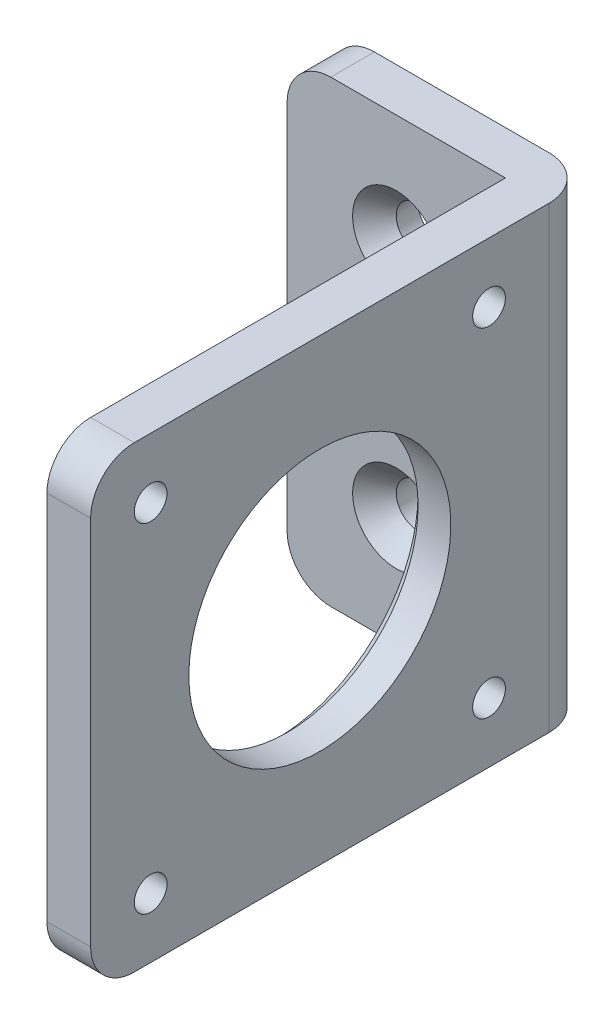
ISO-10303-21;
HEADER;
FILE_DESCRIPTION(('STEP AP214'),'2;1');
FILE_NAME('part.step','',(''),(''),'','','');
FILE_SCHEMA(('AUTOMOTIVE_DESIGN { 1 0 10303 214 1 1 1 1 }'));
ENDSEC;
DATA;
#1=APPLICATION_CONTEXT('core data for automotive mechanical design processes');
#2=APPLICATION_PROTOCOL_DEFINITION('international standard','automotive_design',2000,#1);
#3=PRODUCT_CONTEXT('',#1,'mechanical');
#4=PRODUCT('Part','Part','',(#3));
#5=PRODUCT_RELATED_PRODUCT_CATEGORY('part','',(#4));
#6=PRODUCT_DEFINITION_FORMATION('','',#4);
#7=PRODUCT_DEFINITION_CONTEXT('part definition',#1,'design');
#8=PRODUCT_DEFINITION('design','',#6,#7);
#9=PRODUCT_DEFINITION_SHAPE('','',#8);
#10=(LENGTH_UNIT() NAMED_UNIT(*) SI_UNIT(.MILLI.,.METRE.));
#11=(NAMED_UNIT(*) PLANE_ANGLE_UNIT() SI_UNIT($,.RADIAN.));
#12=(NAMED_UNIT(*) SI_UNIT($,.STERADIAN.) SOLID_ANGLE_UNIT());
#13=UNCERTAINTY_MEASURE_WITH_UNIT(LENGTH_MEASURE(1.E-05),#10,'distance_accuracy_value','');
#14=(GEOMETRIC_REPRESENTATION_CONTEXT(3) GLOBAL_UNCERTAINTY_ASSIGNED_CONTEXT((#13)) GLOBAL_UNIT_ASSIGNED_CONTEXT((#10,
#11,#12)) REPRESENTATION_CONTEXT('',''));
#15=CARTESIAN_POINT('',(0.,0.,0.));
#16=DIRECTION('',(0.,0.,1.));
#17=DIRECTION('',(1.,0.,0.));
#18=AXIS2_PLACEMENT_3D('',#15,#16,#17);
#19=CARTESIAN_POINT('',(-20.,42.,-46.));
#20=DIRECTION('',(0.,0.,1.));
#21=DIRECTION('',(1.,0.,0.));
#22=AXIS2_PLACEMENT_3D('',#19,#20,#21);
#23=PLANE('',#22);
#24=DIRECTION('',(-1.,0.,0.));
#25=VECTOR('',#24,1.);
#26=CARTESIAN_POINT('',(-20.,42.,-46.));
#27=LINE('',#26,#25);
#28=CARTESIAN_POINT('',(0.,42.,-46.));
#29=VERTEX_POINT('',#28);
#30=CARTESIAN_POINT('',(-16.,42.,-46.));
#31=VERTEX_POINT('',#30);
#32=EDGE_CURVE('E133',#29,#31,#27,.T.);
#33=ORIENTED_EDGE('',*,*,#32,.F.);
#34=DIRECTION('',(0.,-1.,0.));
#35=VECTOR('',#34,1.);
#36=CARTESIAN_POINT('',(0.,42.,-46.));
#37=LINE('',#36,#35);
#38=CARTESIAN_POINT('',(0.,0.,-46.));
#39=VERTEX_POINT('',#38);
#40=EDGE_CURVE('E196',#29,#39,#37,.T.);
#41=ORIENTED_EDGE('',*,*,#40,.T.);
#42=DIRECTION('',(-1.,0.,0.));
#43=VECTOR('',#42,1.);
#44=CARTESIAN_POINT('',(-20.,0.,-46.));
#45=LINE('',#44,#43);
#46=CARTESIAN_POINT('',(-16.,0.,-46.));
#47=VERTEX_POINT('',#46);
#48=EDGE_CURVE('E159',#39,#47,#45,.T.);
#49=ORIENTED_EDGE('',*,*,#48,.T.);
#50=CARTESIAN_POINT('',(-16.,4.,-46.));
#51=DIRECTION('',(0.,0.,1.));
#52=DIRECTION('',(1.,0.,0.));
#53=AXIS2_PLACEMENT_3D('',#50,#51,#52);
#54=CIRCLE('',#53,4.);
#55=CARTESIAN_POINT('',(-20.,4.00000000000001,-46.));
#56=VERTEX_POINT('',#55);
#57=EDGE_CURVE('E194',#47,#56,#54,.F.);
#58=ORIENTED_EDGE('',*,*,#57,.T.);
#59=DIRECTION('',(0.,-1.,0.));
#60=VECTOR('',#59,1.);
#61=CARTESIAN_POINT('',(-20.,42.,-46.));
#62=LINE('',#61,#60);
#63=CARTESIAN_POINT('',(-20.,38.,-46.));
#64=VERTEX_POINT('',#63);
#65=EDGE_CURVE('E168',#64,#56,#62,.T.);
#66=ORIENTED_EDGE('',*,*,#65,.F.);
#67=CARTESIAN_POINT('',(-16.,38.,-46.));
#68=DIRECTION('',(0.,0.,1.));
#69=DIRECTION('',(1.,0.,0.));
#70=AXIS2_PLACEMENT_3D('',#67,#68,#69);
#71=CIRCLE('',#70,4.);
#72=EDGE_CURVE('E192',#64,#31,#71,.F.);
#73=ORIENTED_EDGE('',*,*,#72,.T.);
#74=EDGE_LOOP('',(#33,#41,#49,#58,#66,#73));
#75=FACE_BOUND('',#74,.T.);
#76=CARTESIAN_POINT('',(-10.,9.99999999999999,-46.));
#77=DIRECTION('',(0.,0.,1.));
#78=DIRECTION('',(1.,0.,0.));
#79=AXIS2_PLACEMENT_3D('',#76,#77,#78);
#80=CIRCLE('',#79,2.);
#81=CARTESIAN_POINT('',(-8.00000000000003,9.99999999999999,-46.));
#82=VERTEX_POINT('',#81);
#83=EDGE_CURVE('E280',#82,#82,#80,.F.);
#84=ORIENTED_EDGE('',*,*,#83,.F.);
#85=EDGE_LOOP('',(#84));
#86=FACE_BOUND('',#85,.T.);
#87=CARTESIAN_POINT('',(-10.,32.,-46.));
#88=DIRECTION('',(0.,0.,1.));
#89=DIRECTION('',(1.,0.,0.));
#90=AXIS2_PLACEMENT_3D('',#87,#88,#89);
#91=CIRCLE('',#90,2.);
#92=CARTESIAN_POINT('',(-8.,32.,-46.));
#93=VERTEX_POINT('',#92);
#94=EDGE_CURVE('E260',#93,#93,#91,.T.);
#95=ORIENTED_EDGE('',*,*,#94,.T.);
#96=EDGE_LOOP('',(#95));
#97=FACE_BOUND('',#96,.T.);
#98=ADVANCED_FACE('F40',(#75,#86,#97),#23,.F.);
#99=CARTESIAN_POINT('',(0.,42.,-42.));
#100=DIRECTION('',(0.,0.,-1.));
#101=DIRECTION('',(-1.,0.,0.));
#102=AXIS2_PLACEMENT_3D('',#99,#100,#101);
#103=PLANE('',#102);
#104=CARTESIAN_POINT('',(-10.,32.,-42.));
#105=DIRECTION('',(0.,0.,-1.));
#106=DIRECTION('',(-1.,0.,0.));
#107=AXIS2_PLACEMENT_3D('',#104,#105,#106);
#108=CIRCLE('',#107,4.);
#109=CARTESIAN_POINT('',(-14.,32.,-42.));
#110=VERTEX_POINT('',#109);
#111=EDGE_CURVE('E180',#110,#110,#108,.T.);
#112=ORIENTED_EDGE('',*,*,#111,.T.);
#113=EDGE_LOOP('',(#112));
#114=FACE_BOUND('',#113,.T.);
#115=CARTESIAN_POINT('',(-10.,9.99999999999999,-42.));
#116=DIRECTION('',(0.,0.,-1.));
#117=DIRECTION('',(-1.,0.,0.));
#118=AXIS2_PLACEMENT_3D('',#115,#116,#117);
#119=CIRCLE('',#118,4.00000000000001);
#120=CARTESIAN_POINT('',(-14.,9.99999999999999,-42.));
#121=VERTEX_POINT('',#120);
#122=EDGE_CURVE('E177',#121,#121,#119,.T.);
#123=ORIENTED_EDGE('',*,*,#122,.T.);
#124=EDGE_LOOP('',(#123));
#125=FACE_BOUND('',#124,.T.);
#126=DIRECTION('',(0.,-1.,0.));
#127=VECTOR('',#126,1.);
#128=CARTESIAN_POINT('',(-20.,42.,-42.));
#129=LINE('',#128,#127);
#130=CARTESIAN_POINT('',(-20.,38.,-42.));
#131=VERTEX_POINT('',#130);
#132=CARTESIAN_POINT('',(-20.,4.00000000000001,-42.));
#133=VERTEX_POINT('',#132);
#134=EDGE_CURVE('E143',#131,#133,#129,.T.);
#135=ORIENTED_EDGE('',*,*,#134,.T.);
#136=CARTESIAN_POINT('',(-16.,4.,-42.));
#137=DIRECTION('',(0.,0.,-1.));
#138=DIRECTION('',(-1.,0.,0.));
#139=AXIS2_PLACEMENT_3D('',#136,#137,#138);
#140=CIRCLE('',#139,4.);
#141=CARTESIAN_POINT('',(-16.,0.,-42.));
#142=VERTEX_POINT('',#141);
#143=EDGE_CURVE('E12',#133,#142,#140,.F.);
#144=ORIENTED_EDGE('',*,*,#143,.T.);
#145=DIRECTION('',(1.,0.,0.));
#146=VECTOR('',#145,1.);
#147=CARTESIAN_POINT('',(0.,0.,-42.));
#148=LINE('',#147,#146);
#149=CARTESIAN_POINT('',(0.,0.,-42.));
#150=VERTEX_POINT('',#149);
#151=EDGE_CURVE('E139',#142,#150,#148,.T.);
#152=ORIENTED_EDGE('',*,*,#151,.T.);
#153=DIRECTION('',(0.,-1.,0.));
#154=VECTOR('',#153,1.);
#155=CARTESIAN_POINT('',(0.,42.,-42.));
#156=LINE('',#155,#154);
#157=CARTESIAN_POINT('',(0.,42.,-42.));
#158=VERTEX_POINT('',#157);
#159=EDGE_CURVE('E136',#158,#150,#156,.T.);
#160=ORIENTED_EDGE('',*,*,#159,.F.);
#161=DIRECTION('',(1.,0.,0.));
#162=VECTOR('',#161,1.);
#163=CARTESIAN_POINT('',(0.,42.,-42.));
#164=LINE('',#163,#162);
#165=CARTESIAN_POINT('',(-16.,42.,-42.));
#166=VERTEX_POINT('',#165);
#167=EDGE_CURVE('E122',#166,#158,#164,.T.);
#168=ORIENTED_EDGE('',*,*,#167,.F.);
#169=CARTESIAN_POINT('',(-16.,38.,-42.));
#170=DIRECTION('',(0.,0.,-1.));
#171=DIRECTION('',(-1.,0.,0.));
#172=AXIS2_PLACEMENT_3D('',#169,#170,#171);
#173=CIRCLE('',#172,4.);
#174=EDGE_CURVE('E48',#166,#131,#173,.F.);
#175=ORIENTED_EDGE('',*,*,#174,.T.);
#176=EDGE_LOOP('',(#135,#144,#152,#160,#168,#175));
#177=FACE_BOUND('',#176,.T.);
#178=ADVANCED_FACE('F137',(#114,#125,#177),#103,.F.);
#179=CARTESIAN_POINT('',(4.,42.,-46.));
#180=DIRECTION('',(-1.,0.,0.));
#181=DIRECTION('',(0.,0.,1.));
#182=AXIS2_PLACEMENT_3D('',#179,#180,#181);
#183=PLANE('',#182);
#184=CARTESIAN_POINT('',(4.,5.5,-36.5));
#185=DIRECTION('',(-1.,0.,0.));
#186=DIRECTION('',(0.,0.,1.));
#187=AXIS2_PLACEMENT_3D('',#184,#185,#186);
#188=CIRCLE('',#187,1.5);
#189=CARTESIAN_POINT('',(4.,5.5,-35.));
#190=VERTEX_POINT('',#189);
#191=EDGE_CURVE('E256',#190,#190,#188,.T.);
#192=ORIENTED_EDGE('',*,*,#191,.T.);
#193=EDGE_LOOP('',(#192));
#194=FACE_BOUND('',#193,.T.);
#195=CARTESIAN_POINT('',(4.,36.5,-5.50000000000004));
#196=DIRECTION('',(-1.,0.,0.));
#197=DIRECTION('',(0.,0.,1.));
#198=AXIS2_PLACEMENT_3D('',#195,#196,#197);
#199=CIRCLE('',#198,1.5);
#200=CARTESIAN_POINT('',(4.,36.5,-4.00000000000004));
#201=VERTEX_POINT('',#200);
#202=EDGE_CURVE('E269',#201,#201,#199,.T.);
#203=ORIENTED_EDGE('',*,*,#202,.T.);
#204=EDGE_LOOP('',(#203));
#205=FACE_BOUND('',#204,.T.);
#206=CARTESIAN_POINT('',(4.,21.,-21.));
#207=DIRECTION('',(-1.,0.,0.));
#208=DIRECTION('',(0.,0.,1.));
#209=AXIS2_PLACEMENT_3D('',#206,#207,#208);
#210=CIRCLE('',#209,12.);
#211=CARTESIAN_POINT('',(4.,21.,-9.00000000000001));
#212=VERTEX_POINT('',#211);
#213=EDGE_CURVE('E160',#212,#212,#210,.T.);
#214=ORIENTED_EDGE('',*,*,#213,.T.);
#215=EDGE_LOOP('',(#214));
#216=FACE_BOUND('',#215,.T.);
#217=DIRECTION('',(0.,0.,-1.));
#218=VECTOR('',#217,1.);
#219=CARTESIAN_POINT('',(4.,0.,-46.));
#220=LINE('',#219,#218);
#221=CARTESIAN_POINT('',(4.,0.,-4.));
#222=VERTEX_POINT('',#221);
#223=CARTESIAN_POINT('',(4.,0.,-42.));
#224=VERTEX_POINT('',#223);
#225=EDGE_CURVE('E156',#222,#224,#220,.T.);
#226=ORIENTED_EDGE('',*,*,#225,.T.);
#227=DIRECTION('',(0.,-1.,0.));
#228=VECTOR('',#227,1.);
#229=CARTESIAN_POINT('',(4.,42.,-42.));
#230=LINE('',#229,#228);
#231=CARTESIAN_POINT('',(4.,42.,-42.));
#232=VERTEX_POINT('',#231);
#233=EDGE_CURVE('E209',#224,#232,#230,.F.);
#234=ORIENTED_EDGE('',*,*,#233,.T.);
#235=DIRECTION('',(0.,0.,-1.));
#236=VECTOR('',#235,1.);
#237=CARTESIAN_POINT('',(4.,42.,-46.));
#238=LINE('',#237,#236);
#239=CARTESIAN_POINT('',(4.,42.,-4.));
#240=VERTEX_POINT('',#239);
#241=EDGE_CURVE('E165',#240,#232,#238,.T.);
#242=ORIENTED_EDGE('',*,*,#241,.F.);
#243=CARTESIAN_POINT('',(4.,38.,-4.));
#244=DIRECTION('',(-1.,0.,0.));
#245=DIRECTION('',(0.,0.,1.));
#246=AXIS2_PLACEMENT_3D('',#243,#244,#245);
#247=CIRCLE('',#246,4.);
#248=CARTESIAN_POINT('',(4.,38.,0.));
#249=VERTEX_POINT('',#248);
#250=EDGE_CURVE('E205',#240,#249,#247,.F.);
#251=ORIENTED_EDGE('',*,*,#250,.T.);
#252=DIRECTION('',(0.,-1.,0.));
#253=VECTOR('',#252,1.);
#254=CARTESIAN_POINT('',(4.,42.,0.));
#255=LINE('',#254,#253);
#256=CARTESIAN_POINT('',(4.,4.00000000000001,0.));
#257=VERTEX_POINT('',#256);
#258=EDGE_CURVE('E171',#249,#257,#255,.T.);
#259=ORIENTED_EDGE('',*,*,#258,.T.);
#260=CARTESIAN_POINT('',(4.,4.,-4.));
#261=DIRECTION('',(-1.,0.,0.));
#262=DIRECTION('',(0.,0.,1.));
#263=AXIS2_PLACEMENT_3D('',#260,#261,#262);
#264=CIRCLE('',#263,4.);
#265=EDGE_CURVE('E207',#257,#222,#264,.F.);
#266=ORIENTED_EDGE('',*,*,#265,.T.);
#267=EDGE_LOOP('',(#226,#234,#242,#251,#259,#266));
#268=FACE_BOUND('',#267,.T.);
#269=CARTESIAN_POINT('',(4.,36.5,-36.5));
#270=DIRECTION('',(-1.,0.,0.));
#271=DIRECTION('',(0.,0.,1.));
#272=AXIS2_PLACEMENT_3D('',#269,#270,#271);
#273=CIRCLE('',#272,1.5);
#274=CARTESIAN_POINT('',(4.,36.5,-35.));
#275=VERTEX_POINT('',#274);
#276=EDGE_CURVE('E275',#275,#275,#273,.F.);
#277=ORIENTED_EDGE('',*,*,#276,.F.);
#278=EDGE_LOOP('',(#277));
#279=FACE_BOUND('',#278,.T.);
#280=CARTESIAN_POINT('',(4.,5.5,-5.50000000000001));
#281=DIRECTION('',(-1.,0.,0.));
#282=DIRECTION('',(0.,0.,1.));
#283=AXIS2_PLACEMENT_3D('',#280,#281,#282);
#284=CIRCLE('',#283,1.5);
#285=CARTESIAN_POINT('',(4.,5.5,-4.00000000000001));
#286=VERTEX_POINT('',#285);
#287=EDGE_CURVE('E263',#286,#286,#284,.F.);
#288=ORIENTED_EDGE('',*,*,#287,.F.);
#289=EDGE_LOOP('',(#288));
#290=FACE_BOUND('',#289,.T.);
#291=ADVANCED_FACE('F246',(#194,#205,#216,#268,#279,#290),#183,.F.);
#292=CARTESIAN_POINT('',(0.,42.,0.));
#293=DIRECTION('',(1.,0.,0.));
#294=DIRECTION('',(0.,0.,-1.));
#295=AXIS2_PLACEMENT_3D('',#292,#293,#294);
#296=PLANE('',#295);
#297=CARTESIAN_POINT('',(0.,21.,-21.));
#298=DIRECTION('',(1.,0.,0.));
#299=DIRECTION('',(0.,0.,-1.));
#300=AXIS2_PLACEMENT_3D('',#297,#298,#299);
#301=CIRCLE('',#300,13.);
#302=CARTESIAN_POINT('',(0.,21.,-34.));
#303=VERTEX_POINT('',#302);
#304=EDGE_CURVE('E189',#303,#303,#301,.T.);
#305=ORIENTED_EDGE('',*,*,#304,.T.);
#306=EDGE_LOOP('',(#305));
#307=FACE_BOUND('',#306,.T.);
#308=CARTESIAN_POINT('',(0.,5.5,-36.5));
#309=DIRECTION('',(-1.,0.,0.));
#310=DIRECTION('',(0.,0.,1.));
#311=AXIS2_PLACEMENT_3D('',#308,#309,#310);
#312=CIRCLE('',#311,1.5);
#313=CARTESIAN_POINT('',(0.,5.5,-35.));
#314=VERTEX_POINT('',#313);
#315=EDGE_CURVE('E259',#314,#314,#312,.T.);
#316=ORIENTED_EDGE('',*,*,#315,.F.);
#317=EDGE_LOOP('',(#316));
#318=FACE_BOUND('',#317,.T.);
#319=CARTESIAN_POINT('',(0.,36.5,-5.50000000000004));
#320=DIRECTION('',(-1.,0.,0.));
#321=DIRECTION('',(0.,0.,1.));
#322=AXIS2_PLACEMENT_3D('',#319,#320,#321);
#323=CIRCLE('',#322,1.5);
#324=CARTESIAN_POINT('',(0.,36.5,-4.00000000000004));
#325=VERTEX_POINT('',#324);
#326=EDGE_CURVE('E272',#325,#325,#323,.T.);
#327=ORIENTED_EDGE('',*,*,#326,.F.);
#328=EDGE_LOOP('',(#327));
#329=FACE_BOUND('',#328,.T.);
#330=DIRECTION('',(0.,0.,1.));
#331=VECTOR('',#330,1.);
#332=CARTESIAN_POINT('',(0.,0.,0.));
#333=LINE('',#332,#331);
#334=CARTESIAN_POINT('',(0.,0.,-4.));
#335=VERTEX_POINT('',#334);
#336=EDGE_CURVE('E164',#150,#335,#333,.T.);
#337=ORIENTED_EDGE('',*,*,#336,.T.);
#338=CARTESIAN_POINT('',(0.,4.,-4.));
#339=DIRECTION('',(1.,0.,0.));
#340=DIRECTION('',(0.,0.,-1.));
#341=AXIS2_PLACEMENT_3D('',#338,#339,#340);
#342=CIRCLE('',#341,4.);
#343=CARTESIAN_POINT('',(0.,4.00000000000001,0.));
#344=VERTEX_POINT('',#343);
#345=EDGE_CURVE('E222',#335,#344,#342,.F.);
#346=ORIENTED_EDGE('',*,*,#345,.T.);
#347=DIRECTION('',(0.,-1.,0.));
#348=VECTOR('',#347,1.);
#349=CARTESIAN_POINT('',(0.,42.,0.));
#350=LINE('',#349,#348);
#351=CARTESIAN_POINT('',(0.,38.,0.));
#352=VERTEX_POINT('',#351);
#353=EDGE_CURVE('E144',#352,#344,#350,.T.);
#354=ORIENTED_EDGE('',*,*,#353,.F.);
#355=CARTESIAN_POINT('',(0.,38.,-4.));
#356=DIRECTION('',(1.,0.,0.));
#357=DIRECTION('',(0.,0.,-1.));
#358=AXIS2_PLACEMENT_3D('',#355,#356,#357);
#359=CIRCLE('',#358,4.);
#360=CARTESIAN_POINT('',(0.,42.,-4.));
#361=VERTEX_POINT('',#360);
#362=EDGE_CURVE('E150',#352,#361,#359,.F.);
#363=ORIENTED_EDGE('',*,*,#362,.T.);
#364=DIRECTION('',(0.,0.,1.));
#365=VECTOR('',#364,1.);
#366=CARTESIAN_POINT('',(0.,42.,0.));
#367=LINE('',#366,#365);
#368=EDGE_CURVE('E128',#158,#361,#367,.T.);
#369=ORIENTED_EDGE('',*,*,#368,.F.);
#370=ORIENTED_EDGE('',*,*,#159,.T.);
#371=EDGE_LOOP('',(#337,#346,#354,#363,#369,#370));
#372=FACE_BOUND('',#371,.T.);
#373=CARTESIAN_POINT('',(0.,36.5,-36.5));
#374=DIRECTION('',(-1.,0.,0.));
#375=DIRECTION('',(0.,0.,1.));
#376=AXIS2_PLACEMENT_3D('',#373,#374,#375);
#377=CIRCLE('',#376,1.5);
#378=CARTESIAN_POINT('',(0.,36.5,-35.));
#379=VERTEX_POINT('',#378);
#380=EDGE_CURVE('E255',#379,#379,#377,.F.);
#381=ORIENTED_EDGE('',*,*,#380,.T.);
#382=EDGE_LOOP('',(#381));
#383=FACE_BOUND('',#382,.T.);
#384=CARTESIAN_POINT('',(0.,5.5,-5.50000000000001));
#385=DIRECTION('',(-1.,0.,0.));
#386=DIRECTION('',(0.,0.,1.));
#387=AXIS2_PLACEMENT_3D('',#384,#385,#386);
#388=CIRCLE('',#387,1.5);
#389=CARTESIAN_POINT('',(0.,5.5,-4.00000000000001));
#390=VERTEX_POINT('',#389);
#391=EDGE_CURVE('E266',#390,#390,#388,.F.);
#392=ORIENTED_EDGE('',*,*,#391,.T.);
#393=EDGE_LOOP('',(#392));
#394=FACE_BOUND('',#393,.T.);
#395=ADVANCED_FACE('F146',(#307,#318,#329,#372,#383,#394),#296,.F.);
#396=CARTESIAN_POINT('',(4.,42.,0.));
#397=DIRECTION('',(0.,0.,-1.));
#398=DIRECTION('',(-1.,0.,0.));
#399=AXIS2_PLACEMENT_3D('',#396,#397,#398);
#400=PLANE('',#399);
#401=ORIENTED_EDGE('',*,*,#353,.T.);
#402=DIRECTION('',(1.,0.,0.));
#403=VECTOR('',#402,1.);
#404=CARTESIAN_POINT('',(4.,4.,0.));
#405=LINE('',#404,#403);
#406=EDGE_CURVE('E218',#344,#257,#405,.T.);
#407=ORIENTED_EDGE('',*,*,#406,.T.);
#408=ORIENTED_EDGE('',*,*,#258,.F.);
#409=DIRECTION('',(1.,0.,0.));
#410=VECTOR('',#409,1.);
#411=CARTESIAN_POINT('',(4.,38.,0.));
#412=LINE('',#411,#410);
#413=EDGE_CURVE('E216',#249,#352,#412,.F.);
#414=ORIENTED_EDGE('',*,*,#413,.T.);
#415=EDGE_LOOP('',(#401,#407,#408,#414));
#416=FACE_BOUND('',#415,.T.);
#417=ADVANCED_FACE('F315',(#416),#400,.F.);
#418=CARTESIAN_POINT('',(-20.,42.,-42.));
#419=DIRECTION('',(1.,0.,0.));
#420=DIRECTION('',(0.,0.,-1.));
#421=AXIS2_PLACEMENT_3D('',#418,#419,#420);
#422=PLANE('',#421);
#423=ORIENTED_EDGE('',*,*,#65,.T.);
#424=DIRECTION('',(0.,0.,1.));
#425=VECTOR('',#424,1.);
#426=CARTESIAN_POINT('',(-20.,4.,-42.));
#427=LINE('',#426,#425);
#428=EDGE_CURVE('E226',#56,#133,#427,.T.);
#429=ORIENTED_EDGE('',*,*,#428,.T.);
#430=ORIENTED_EDGE('',*,*,#134,.F.);
#431=DIRECTION('',(0.,0.,1.));
#432=VECTOR('',#431,1.);
#433=CARTESIAN_POINT('',(-20.,38.,-42.));
#434=LINE('',#433,#432);
#435=EDGE_CURVE('E224',#131,#64,#434,.F.);
#436=ORIENTED_EDGE('',*,*,#435,.T.);
#437=EDGE_LOOP('',(#423,#429,#430,#436));
#438=FACE_BOUND('',#437,.T.);
#439=ADVANCED_FACE('F228',(#438),#422,.F.);
#440=CARTESIAN_POINT('',(0.,42.,0.));
#441=DIRECTION('',(0.,-1.,0.));
#442=DIRECTION('',(0.,0.,-1.));
#443=AXIS2_PLACEMENT_3D('',#440,#441,#442);
#444=PLANE('',#443);
#445=ORIENTED_EDGE('',*,*,#241,.T.);
#446=CARTESIAN_POINT('',(0.,42.,-42.));
#447=DIRECTION('',(0.,-1.,0.));
#448=DIRECTION('',(0.,0.,-1.));
#449=AXIS2_PLACEMENT_3D('',#446,#447,#448);
#450=CIRCLE('',#449,4.);
#451=EDGE_CURVE('E214',#232,#29,#450,.F.);
#452=ORIENTED_EDGE('',*,*,#451,.T.);
#453=ORIENTED_EDGE('',*,*,#32,.T.);
#454=DIRECTION('',(0.,0.,1.));
#455=VECTOR('',#454,1.);
#456=CARTESIAN_POINT('',(-16.,42.,0.));
#457=LINE('',#456,#455);
#458=EDGE_CURVE('E132',#31,#166,#457,.T.);
#459=ORIENTED_EDGE('',*,*,#458,.T.);
#460=ORIENTED_EDGE('',*,*,#167,.T.);
#461=ORIENTED_EDGE('',*,*,#368,.T.);
#462=DIRECTION('',(1.,0.,0.));
#463=VECTOR('',#462,1.);
#464=CARTESIAN_POINT('',(0.,42.,-4.));
#465=LINE('',#464,#463);
#466=EDGE_CURVE('E212',#361,#240,#465,.T.);
#467=ORIENTED_EDGE('',*,*,#466,.T.);
#468=EDGE_LOOP('',(#445,#452,#453,#459,#460,#461,#467));
#469=FACE_BOUND('',#468,.T.);
#470=ADVANCED_FACE('F125',(#469),#444,.F.);
#471=CARTESIAN_POINT('',(0.,0.,0.));
#472=DIRECTION('',(0.,-1.,0.));
#473=DIRECTION('',(0.,0.,-1.));
#474=AXIS2_PLACEMENT_3D('',#471,#472,#473);
#475=PLANE('',#474);
#476=ORIENTED_EDGE('',*,*,#48,.F.);
#477=CARTESIAN_POINT('',(0.,0.,-42.));
#478=DIRECTION('',(0.,-1.,0.));
#479=DIRECTION('',(0.,0.,-1.));
#480=AXIS2_PLACEMENT_3D('',#477,#478,#479);
#481=CIRCLE('',#480,4.);
#482=EDGE_CURVE('E203',#39,#224,#481,.T.);
#483=ORIENTED_EDGE('',*,*,#482,.T.);
#484=ORIENTED_EDGE('',*,*,#225,.F.);
#485=DIRECTION('',(1.,0.,0.));
#486=VECTOR('',#485,1.);
#487=CARTESIAN_POINT('',(0.,0.,-4.));
#488=LINE('',#487,#486);
#489=EDGE_CURVE('E201',#222,#335,#488,.F.);
#490=ORIENTED_EDGE('',*,*,#489,.T.);
#491=ORIENTED_EDGE('',*,*,#336,.F.);
#492=ORIENTED_EDGE('',*,*,#151,.F.);
#493=DIRECTION('',(0.,0.,1.));
#494=VECTOR('',#493,1.);
#495=CARTESIAN_POINT('',(-16.,0.,-46.));
#496=LINE('',#495,#494);
#497=EDGE_CURVE('E199',#142,#47,#496,.F.);
#498=ORIENTED_EDGE('',*,*,#497,.T.);
#499=EDGE_LOOP('',(#476,#483,#484,#490,#491,#492,#498));
#500=FACE_BOUND('',#499,.T.);
#501=ADVANCED_FACE('F234',(#500),#475,.T.);
#502=CARTESIAN_POINT('',(4.,21.,-21.));
#503=DIRECTION('',(-1.,0.,0.));
#504=DIRECTION('',(0.,0.,1.));
#505=AXIS2_PLACEMENT_3D('',#502,#503,#504);
#506=CYLINDRICAL_SURFACE('',#505,12.);
#507=CARTESIAN_POINT('',(1.00000000000001,21.,-21.));
#508=DIRECTION('',(1.,0.,0.));
#509=DIRECTION('',(0.,0.,-1.));
#510=AXIS2_PLACEMENT_3D('',#507,#508,#509);
#511=CIRCLE('',#510,12.);
#512=CARTESIAN_POINT('',(1.00000000000001,21.,-33.));
#513=VERTEX_POINT('',#512);
#514=EDGE_CURVE('E186',#513,#513,#511,.F.);
#515=ORIENTED_EDGE('',*,*,#514,.T.);
#516=EDGE_LOOP('',(#515));
#517=FACE_BOUND('',#516,.T.);
#518=ORIENTED_EDGE('',*,*,#213,.F.);
#519=EDGE_LOOP('',(#518));
#520=FACE_BOUND('',#519,.T.);
#521=ADVANCED_FACE('F374',(#517,#520),#506,.F.);
#522=CARTESIAN_POINT('',(4.,36.5,-36.5));
#523=DIRECTION('',(-1.,0.,0.));
#524=DIRECTION('',(0.,0.,1.));
#525=AXIS2_PLACEMENT_3D('',#522,#523,#524);
#526=CYLINDRICAL_SURFACE('',#525,1.5);
#527=ORIENTED_EDGE('',*,*,#276,.T.);
#528=EDGE_LOOP('',(#527));
#529=FACE_BOUND('',#528,.T.);
#530=ORIENTED_EDGE('',*,*,#380,.F.);
#531=EDGE_LOOP('',(#530));
#532=FACE_BOUND('',#531,.T.);
#533=ADVANCED_FACE('F437',(#529,#532),#526,.F.);
#534=CARTESIAN_POINT('',(4.,36.5,-5.50000000000004));
#535=DIRECTION('',(-1.,0.,0.));
#536=DIRECTION('',(0.,0.,1.));
#537=AXIS2_PLACEMENT_3D('',#534,#535,#536);
#538=CYLINDRICAL_SURFACE('',#537,1.5);
#539=ORIENTED_EDGE('',*,*,#202,.F.);
#540=EDGE_LOOP('',(#539));
#541=FACE_BOUND('',#540,.T.);
#542=ORIENTED_EDGE('',*,*,#326,.T.);
#543=EDGE_LOOP('',(#542));
#544=FACE_BOUND('',#543,.T.);
#545=ADVANCED_FACE('F479',(#541,#544),#538,.F.);
#546=CARTESIAN_POINT('',(4.,5.5,-5.50000000000001));
#547=DIRECTION('',(-1.,0.,0.));
#548=DIRECTION('',(0.,0.,1.));
#549=AXIS2_PLACEMENT_3D('',#546,#547,#548);
#550=CYLINDRICAL_SURFACE('',#549,1.5);
#551=ORIENTED_EDGE('',*,*,#287,.T.);
#552=EDGE_LOOP('',(#551));
#553=FACE_BOUND('',#552,.T.);
#554=ORIENTED_EDGE('',*,*,#391,.F.);
#555=EDGE_LOOP('',(#554));
#556=FACE_BOUND('',#555,.T.);
#557=ADVANCED_FACE('F469',(#553,#556),#550,.F.);
#558=CARTESIAN_POINT('',(4.,5.5,-36.5));
#559=DIRECTION('',(-1.,0.,0.));
#560=DIRECTION('',(0.,0.,1.));
#561=AXIS2_PLACEMENT_3D('',#558,#559,#560);
#562=CYLINDRICAL_SURFACE('',#561,1.5);
#563=ORIENTED_EDGE('',*,*,#191,.F.);
#564=EDGE_LOOP('',(#563));
#565=FACE_BOUND('',#564,.T.);
#566=ORIENTED_EDGE('',*,*,#315,.T.);
#567=EDGE_LOOP('',(#566));
#568=FACE_BOUND('',#567,.T.);
#569=ADVANCED_FACE('F300',(#565,#568),#562,.F.);
#570=CARTESIAN_POINT('',(-10.,9.99999999999999,-46.));
#571=DIRECTION('',(0.,0.,1.));
#572=DIRECTION('',(1.,0.,0.));
#573=AXIS2_PLACEMENT_3D('',#570,#571,#572);
#574=CYLINDRICAL_SURFACE('',#573,2.);
#575=CARTESIAN_POINT('',(-10.,9.99999999999999,-44.));
#576=DIRECTION('',(0.,0.,-1.));
#577=DIRECTION('',(-1.,0.,0.));
#578=AXIS2_PLACEMENT_3D('',#575,#576,#577);
#579=CIRCLE('',#578,2.);
#580=CARTESIAN_POINT('',(-12.,9.99999999999999,-44.));
#581=VERTEX_POINT('',#580);
#582=EDGE_CURVE('E183',#581,#581,#579,.F.);
#583=ORIENTED_EDGE('',*,*,#582,.T.);
#584=EDGE_LOOP('',(#583));
#585=FACE_BOUND('',#584,.T.);
#586=ORIENTED_EDGE('',*,*,#83,.T.);
#587=EDGE_LOOP('',(#586));
#588=FACE_BOUND('',#587,.T.);
#589=ADVANCED_FACE('F290',(#585,#588),#574,.F.);
#590=CARTESIAN_POINT('',(-10.,32.,-46.));
#591=DIRECTION('',(0.,0.,1.));
#592=DIRECTION('',(1.,0.,0.));
#593=AXIS2_PLACEMENT_3D('',#590,#591,#592);
#594=CYLINDRICAL_SURFACE('',#593,2.);
#595=CARTESIAN_POINT('',(-10.,32.,-44.));
#596=DIRECTION('',(0.,0.,-1.));
#597=DIRECTION('',(-1.,0.,0.));
#598=AXIS2_PLACEMENT_3D('',#595,#596,#597);
#599=CIRCLE('',#598,2.);
#600=CARTESIAN_POINT('',(-12.,32.,-44.));
#601=VERTEX_POINT('',#600);
#602=EDGE_CURVE('E174',#601,#601,#599,.F.);
#603=ORIENTED_EDGE('',*,*,#602,.T.);
#604=EDGE_LOOP('',(#603));
#605=FACE_BOUND('',#604,.T.);
#606=ORIENTED_EDGE('',*,*,#94,.F.);
#607=EDGE_LOOP('',(#606));
#608=FACE_BOUND('',#607,.T.);
#609=ADVANCED_FACE('F287',(#605,#608),#594,.F.);
#610=CARTESIAN_POINT('',(-10.,32.,-44.));
#611=DIRECTION('',(0.,0.,1.));
#612=DIRECTION('',(1.,0.,0.));
#613=AXIS2_PLACEMENT_3D('',#610,#611,#612);
#614=CONICAL_SURFACE('',#613,2.,0.785398163397449);
#615=ORIENTED_EDGE('',*,*,#111,.F.);
#616=EDGE_LOOP('',(#615));
#617=FACE_BOUND('',#616,.T.);
#618=ORIENTED_EDGE('',*,*,#602,.F.);
#619=EDGE_LOOP('',(#618));
#620=FACE_BOUND('',#619,.T.);
#621=ADVANCED_FACE('F289',(#617,#620),#614,.F.);
#622=CARTESIAN_POINT('',(-10.,9.99999999999999,-42.));
#623=DIRECTION('',(0.,0.,1.));
#624=DIRECTION('',(1.,0.,0.));
#625=AXIS2_PLACEMENT_3D('',#622,#623,#624);
#626=CONICAL_SURFACE('',#625,4.00000000000001,0.785398163397447);
#627=ORIENTED_EDGE('',*,*,#582,.F.);
#628=EDGE_LOOP('',(#627));
#629=FACE_BOUND('',#628,.T.);
#630=ORIENTED_EDGE('',*,*,#122,.F.);
#631=EDGE_LOOP('',(#630));
#632=FACE_BOUND('',#631,.T.);
#633=ADVANCED_FACE('F297',(#629,#632),#626,.F.);
#634=CARTESIAN_POINT('',(1.00000000000001,21.,-21.));
#635=DIRECTION('',(-1.,0.,0.));
#636=DIRECTION('',(0.,0.,1.));
#637=AXIS2_PLACEMENT_3D('',#634,#635,#636);
#638=CONICAL_SURFACE('',#637,12.,0.785398163397447);
#639=ORIENTED_EDGE('',*,*,#304,.F.);
#640=EDGE_LOOP('',(#639));
#641=FACE_BOUND('',#640,.T.);
#642=ORIENTED_EDGE('',*,*,#514,.F.);
#643=EDGE_LOOP('',(#642));
#644=FACE_BOUND('',#643,.T.);
#645=ADVANCED_FACE('F321',(#641,#644),#638,.F.);
#646=CARTESIAN_POINT('',(0.,42.,-42.));
#647=DIRECTION('',(0.,-1.,0.));
#648=DIRECTION('',(0.,0.,-1.));
#649=AXIS2_PLACEMENT_3D('',#646,#647,#648);
#650=CYLINDRICAL_SURFACE('',#649,4.);
#651=ORIENTED_EDGE('',*,*,#451,.F.);
#652=ORIENTED_EDGE('',*,*,#233,.F.);
#653=ORIENTED_EDGE('',*,*,#482,.F.);
#654=ORIENTED_EDGE('',*,*,#40,.F.);
#655=EDGE_LOOP('',(#651,#652,#653,#654));
#656=FACE_BOUND('',#655,.T.);
#657=ADVANCED_FACE('F250',(#656),#650,.T.);
#658=CARTESIAN_POINT('',(4.,4.,-4.));
#659=DIRECTION('',(-1.,0.,0.));
#660=DIRECTION('',(0.,0.,1.));
#661=AXIS2_PLACEMENT_3D('',#658,#659,#660);
#662=CYLINDRICAL_SURFACE('',#661,4.);
#663=ORIENTED_EDGE('',*,*,#345,.F.);
#664=ORIENTED_EDGE('',*,*,#489,.F.);
#665=ORIENTED_EDGE('',*,*,#265,.F.);
#666=ORIENTED_EDGE('',*,*,#406,.F.);
#667=EDGE_LOOP('',(#663,#664,#665,#666));
#668=FACE_BOUND('',#667,.T.);
#669=ADVANCED_FACE('F328',(#668),#662,.T.);
#670=CARTESIAN_POINT('',(0.,38.,-4.));
#671=DIRECTION('',(1.,0.,0.));
#672=DIRECTION('',(0.,0.,-1.));
#673=AXIS2_PLACEMENT_3D('',#670,#671,#672);
#674=CYLINDRICAL_SURFACE('',#673,4.);
#675=ORIENTED_EDGE('',*,*,#362,.F.);
#676=ORIENTED_EDGE('',*,*,#413,.F.);
#677=ORIENTED_EDGE('',*,*,#250,.F.);
#678=ORIENTED_EDGE('',*,*,#466,.F.);
#679=EDGE_LOOP('',(#675,#676,#677,#678));
#680=FACE_BOUND('',#679,.T.);
#681=ADVANCED_FACE('F331',(#680),#674,.T.);
#682=CARTESIAN_POINT('',(-16.,4.,-42.));
#683=DIRECTION('',(0.,0.,-1.));
#684=DIRECTION('',(-1.,0.,0.));
#685=AXIS2_PLACEMENT_3D('',#682,#683,#684);
#686=CYLINDRICAL_SURFACE('',#685,4.);
#687=ORIENTED_EDGE('',*,*,#57,.F.);
#688=ORIENTED_EDGE('',*,*,#497,.F.);
#689=ORIENTED_EDGE('',*,*,#143,.F.);
#690=ORIENTED_EDGE('',*,*,#428,.F.);
#691=EDGE_LOOP('',(#687,#688,#689,#690));
#692=FACE_BOUND('',#691,.T.);
#693=ADVANCED_FACE('F235',(#692),#686,.T.);
#694=CARTESIAN_POINT('',(-16.,38.,0.));
#695=DIRECTION('',(0.,0.,1.));
#696=DIRECTION('',(1.,0.,0.));
#697=AXIS2_PLACEMENT_3D('',#694,#695,#696);
#698=CYLINDRICAL_SURFACE('',#697,4.);
#699=ORIENTED_EDGE('',*,*,#72,.F.);
#700=ORIENTED_EDGE('',*,*,#435,.F.);
#701=ORIENTED_EDGE('',*,*,#174,.F.);
#702=ORIENTED_EDGE('',*,*,#458,.F.);
#703=EDGE_LOOP('',(#699,#700,#701,#702));
#704=FACE_BOUND('',#703,.T.);
#705=ADVANCED_FACE('F42',(#704),#698,.T.);
#706=CLOSED_SHELL('',(#98,#178,#291,#395,#417,#439,#470,#501,#521,#533,#545,#557,#569,#589,#609,
#621,#633,#645,#657,#669,#681,#693,#705));
#707=MANIFOLD_SOLID_BREP('B2',#706);
#708=ADVANCED_BREP_SHAPE_REPRESENTATION('',(#18,#707),#14);
#709=SHAPE_DEFINITION_REPRESENTATION(#9,#708);
ENDSEC;
END-ISO-10303-21;
